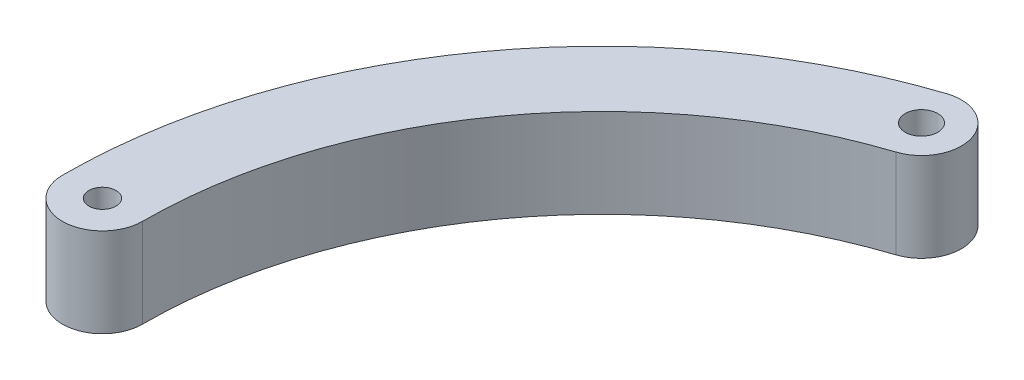
ISO-10303-21;
HEADER;
FILE_DESCRIPTION(('STEP AP214'),'2;1');
FILE_NAME('part.step','',(''),(''),'','','');
FILE_SCHEMA(('AUTOMOTIVE_DESIGN { 1 0 10303 214 1 1 1 1 }'));
ENDSEC;
DATA;
#1=APPLICATION_CONTEXT('core data for automotive mechanical design processes');
#2=APPLICATION_PROTOCOL_DEFINITION('international standard','automotive_design',2000,#1);
#3=PRODUCT_CONTEXT('',#1,'mechanical');
#4=PRODUCT('Part','Part','',(#3));
#5=PRODUCT_RELATED_PRODUCT_CATEGORY('part','',(#4));
#6=PRODUCT_DEFINITION_FORMATION('','',#4);
#7=PRODUCT_DEFINITION_CONTEXT('part definition',#1,'design');
#8=PRODUCT_DEFINITION('design','',#6,#7);
#9=PRODUCT_DEFINITION_SHAPE('','',#8);
#10=(LENGTH_UNIT() NAMED_UNIT(*) SI_UNIT(.MILLI.,.METRE.));
#11=(NAMED_UNIT(*) PLANE_ANGLE_UNIT() SI_UNIT($,.RADIAN.));
#12=(NAMED_UNIT(*) SI_UNIT($,.STERADIAN.) SOLID_ANGLE_UNIT());
#13=UNCERTAINTY_MEASURE_WITH_UNIT(LENGTH_MEASURE(1.E-05),#10,'distance_accuracy_value','');
#14=(GEOMETRIC_REPRESENTATION_CONTEXT(3) GLOBAL_UNCERTAINTY_ASSIGNED_CONTEXT((#13)) GLOBAL_UNIT_ASSIGNED_CONTEXT((#10,
#11,#12)) REPRESENTATION_CONTEXT('',''));
#15=CARTESIAN_POINT('',(0.,0.,0.));
#16=DIRECTION('',(0.,0.,1.));
#17=DIRECTION('',(1.,0.,0.));
#18=AXIS2_PLACEMENT_3D('',#15,#16,#17);
#19=CARTESIAN_POINT('',(-18.25625,6.51002,0.));
#20=DIRECTION('',(0.,-1.,0.));
#21=DIRECTION('',(0.,0.,-1.));
#22=AXIS2_PLACEMENT_3D('',#19,#20,#21);
#23=PLANE('',#22);
#24=CARTESIAN_POINT('',(-36.5125,6.51002,0.));
#25=DIRECTION('',(0.,1.,0.));
#26=DIRECTION('',(0.,0.,-1.));
#27=AXIS2_PLACEMENT_3D('',#24,#25,#26);
#28=CIRCLE('',#27,2.9219891931734);
#29=CARTESIAN_POINT('',(-39.4344891931734,6.51002,0.));
#30=VERTEX_POINT('',#29);
#31=CARTESIAN_POINT('',(-33.5905108068266,6.51002,0.));
#32=VERTEX_POINT('',#31);
#33=EDGE_CURVE('E85',#30,#32,#28,.T.);
#34=ORIENTED_EDGE('',*,*,#33,.T.);
#35=CARTESIAN_POINT('',(0.,6.51002,0.));
#36=DIRECTION('',(0.,-1.,0.));
#37=DIRECTION('',(0.,0.,-1.));
#38=AXIS2_PLACEMENT_3D('',#35,#36,#37);
#39=CIRCLE('',#38,33.5905108068266);
#40=CARTESIAN_POINT('',(-10.4454423964517,6.51002,-31.9251491681079));
#41=VERTEX_POINT('',#40);
#42=EDGE_CURVE('E80',#32,#41,#39,.T.);
#43=ORIENTED_EDGE('',*,*,#42,.T.);
#44=CARTESIAN_POINT('',(-11.3540760869565,6.51002,-34.7022709986191));
#45=DIRECTION('',(0.,1.,0.));
#46=DIRECTION('',(0.,0.,1.));
#47=AXIS2_PLACEMENT_3D('',#44,#45,#46);
#48=CIRCLE('',#47,2.9219891931734);
#49=CARTESIAN_POINT('',(-12.2627097774613,6.51002,-37.4793928291303));
#50=VERTEX_POINT('',#49);
#51=EDGE_CURVE('E83',#41,#50,#48,.T.);
#52=ORIENTED_EDGE('',*,*,#51,.T.);
#53=CARTESIAN_POINT('',(0.,6.51002,0.));
#54=DIRECTION('',(0.,1.,0.));
#55=DIRECTION('',(0.,0.,-1.));
#56=AXIS2_PLACEMENT_3D('',#53,#54,#55);
#57=CIRCLE('',#56,39.4344891931734);
#58=EDGE_CURVE('E50',#50,#30,#57,.T.);
#59=ORIENTED_EDGE('',*,*,#58,.T.);
#60=EDGE_LOOP('',(#34,#43,#52,#59));
#61=FACE_BOUND('',#60,.T.);
#62=CARTESIAN_POINT('',(-11.3540760869565,6.51002,-34.7022709986191));
#63=DIRECTION('',(0.,1.,0.));
#64=DIRECTION('',(0.,0.,1.));
#65=AXIS2_PLACEMENT_3D('',#62,#63,#64);
#66=CIRCLE('',#65,1.190625);
#67=CARTESIAN_POINT('',(-11.3540760869565,6.51002,-33.5116459986191));
#68=VERTEX_POINT('',#67);
#69=EDGE_CURVE('E100',#68,#68,#66,.T.);
#70=ORIENTED_EDGE('',*,*,#69,.F.);
#71=EDGE_LOOP('',(#70));
#72=FACE_BOUND('',#71,.T.);
#73=CARTESIAN_POINT('',(-36.5125,6.51002,0.));
#74=DIRECTION('',(0.,1.,0.));
#75=DIRECTION('',(0.,0.,1.));
#76=AXIS2_PLACEMENT_3D('',#73,#74,#75);
#77=CIRCLE('',#76,0.992187499999998);
#78=CARTESIAN_POINT('',(-36.5125,6.51002,0.992187499999998));
#79=VERTEX_POINT('',#78);
#80=EDGE_CURVE('E115',#79,#79,#77,.T.);
#81=ORIENTED_EDGE('',*,*,#80,.F.);
#82=EDGE_LOOP('',(#81));
#83=FACE_BOUND('',#82,.T.);
#84=ADVANCED_FACE('F33',(#61,#72,#83),#23,.F.);
#85=CARTESIAN_POINT('',(-18.25625,0.,0.));
#86=DIRECTION('',(0.,-1.,0.));
#87=DIRECTION('',(0.,0.,-1.));
#88=AXIS2_PLACEMENT_3D('',#85,#86,#87);
#89=PLANE('',#88);
#90=CARTESIAN_POINT('',(-11.3540760869565,0.,-34.7022709986191));
#91=DIRECTION('',(0.,1.,0.));
#92=DIRECTION('',(0.,0.,1.));
#93=AXIS2_PLACEMENT_3D('',#90,#91,#92);
#94=CIRCLE('',#93,1.190625);
#95=CARTESIAN_POINT('',(-11.3540760869565,0.,-33.5116459986191));
#96=VERTEX_POINT('',#95);
#97=EDGE_CURVE('E112',#96,#96,#94,.T.);
#98=ORIENTED_EDGE('',*,*,#97,.T.);
#99=EDGE_LOOP('',(#98));
#100=FACE_BOUND('',#99,.T.);
#101=CARTESIAN_POINT('',(-36.5125,0.,0.));
#102=DIRECTION('',(0.,1.,0.));
#103=DIRECTION('',(0.,0.,-1.));
#104=AXIS2_PLACEMENT_3D('',#101,#102,#103);
#105=CIRCLE('',#104,2.9219891931734);
#106=CARTESIAN_POINT('',(-39.4344891931734,0.,0.));
#107=VERTEX_POINT('',#106);
#108=CARTESIAN_POINT('',(-33.5905108068266,0.,0.));
#109=VERTEX_POINT('',#108);
#110=EDGE_CURVE('E97',#107,#109,#105,.T.);
#111=ORIENTED_EDGE('',*,*,#110,.F.);
#112=CARTESIAN_POINT('',(0.,0.,0.));
#113=DIRECTION('',(0.,1.,0.));
#114=DIRECTION('',(0.,0.,-1.));
#115=AXIS2_PLACEMENT_3D('',#112,#113,#114);
#116=CIRCLE('',#115,39.4344891931734);
#117=CARTESIAN_POINT('',(-12.2627097774613,0.,-37.4793928291303));
#118=VERTEX_POINT('',#117);
#119=EDGE_CURVE('E73',#118,#107,#116,.T.);
#120=ORIENTED_EDGE('',*,*,#119,.F.);
#121=CARTESIAN_POINT('',(-11.3540760869565,0.,-34.7022709986191));
#122=DIRECTION('',(0.,1.,0.));
#123=DIRECTION('',(0.,0.,1.));
#124=AXIS2_PLACEMENT_3D('',#121,#122,#123);
#125=CIRCLE('',#124,2.9219891931734);
#126=CARTESIAN_POINT('',(-10.4454423964517,0.,-31.9251491681079));
#127=VERTEX_POINT('',#126);
#128=EDGE_CURVE('E67',#127,#118,#125,.T.);
#129=ORIENTED_EDGE('',*,*,#128,.F.);
#130=CARTESIAN_POINT('',(0.,0.,0.));
#131=DIRECTION('',(0.,-1.,0.));
#132=DIRECTION('',(0.,0.,-1.));
#133=AXIS2_PLACEMENT_3D('',#130,#131,#132);
#134=CIRCLE('',#133,33.5905108068266);
#135=EDGE_CURVE('E89',#109,#127,#134,.T.);
#136=ORIENTED_EDGE('',*,*,#135,.F.);
#137=EDGE_LOOP('',(#111,#120,#129,#136));
#138=FACE_BOUND('',#137,.T.);
#139=CARTESIAN_POINT('',(-36.5125,0.,0.));
#140=DIRECTION('',(0.,1.,0.));
#141=DIRECTION('',(0.,0.,1.));
#142=AXIS2_PLACEMENT_3D('',#139,#140,#141);
#143=CIRCLE('',#142,0.992187499999998);
#144=CARTESIAN_POINT('',(-36.5125,0.,0.992187499999998));
#145=VERTEX_POINT('',#144);
#146=EDGE_CURVE('E118',#145,#145,#143,.T.);
#147=ORIENTED_EDGE('',*,*,#146,.T.);
#148=EDGE_LOOP('',(#147));
#149=FACE_BOUND('',#148,.T.);
#150=ADVANCED_FACE('F108',(#100,#138,#149),#89,.T.);
#151=CARTESIAN_POINT('',(-36.5125,6.51002,0.));
#152=DIRECTION('',(0.,-1.,0.));
#153=DIRECTION('',(0.,0.,-1.));
#154=AXIS2_PLACEMENT_3D('',#151,#152,#153);
#155=CYLINDRICAL_SURFACE('',#154,2.9219891931734);
#156=ORIENTED_EDGE('',*,*,#110,.T.);
#157=DIRECTION('',(0.,-1.,0.));
#158=VECTOR('',#157,1.);
#159=CARTESIAN_POINT('',(-33.5905108068266,6.51002,0.));
#160=LINE('',#159,#158);
#161=EDGE_CURVE('E11',#32,#109,#160,.T.);
#162=ORIENTED_EDGE('',*,*,#161,.F.);
#163=ORIENTED_EDGE('',*,*,#33,.F.);
#164=DIRECTION('',(0.,-1.,0.));
#165=VECTOR('',#164,1.);
#166=CARTESIAN_POINT('',(-39.4344891931734,6.51002,0.));
#167=LINE('',#166,#165);
#168=EDGE_CURVE('E93',#30,#107,#167,.T.);
#169=ORIENTED_EDGE('',*,*,#168,.T.);
#170=EDGE_LOOP('',(#156,#162,#163,#169));
#171=FACE_BOUND('',#170,.T.);
#172=ADVANCED_FACE('F35',(#171),#155,.T.);
#173=CARTESIAN_POINT('',(0.,6.51002,0.));
#174=DIRECTION('',(0.,-1.,0.));
#175=DIRECTION('',(0.,0.,-1.));
#176=AXIS2_PLACEMENT_3D('',#173,#174,#175);
#177=CYLINDRICAL_SURFACE('',#176,33.5905108068266);
#178=ORIENTED_EDGE('',*,*,#135,.T.);
#179=DIRECTION('',(0.,-1.,0.));
#180=VECTOR('',#179,1.);
#181=CARTESIAN_POINT('',(-10.4454423964517,6.51002,-31.9251491681079));
#182=LINE('',#181,#180);
#183=EDGE_CURVE('E42',#41,#127,#182,.T.);
#184=ORIENTED_EDGE('',*,*,#183,.F.);
#185=ORIENTED_EDGE('',*,*,#42,.F.);
#186=ORIENTED_EDGE('',*,*,#161,.T.);
#187=EDGE_LOOP('',(#178,#184,#185,#186));
#188=FACE_BOUND('',#187,.T.);
#189=ADVANCED_FACE('F88',(#188),#177,.F.);
#190=CARTESIAN_POINT('',(-11.3540760869565,6.51002,-34.7022709986191));
#191=DIRECTION('',(0.,-1.,0.));
#192=DIRECTION('',(0.,0.,-1.));
#193=AXIS2_PLACEMENT_3D('',#190,#191,#192);
#194=CYLINDRICAL_SURFACE('',#193,2.9219891931734);
#195=ORIENTED_EDGE('',*,*,#128,.T.);
#196=DIRECTION('',(0.,-1.,0.));
#197=VECTOR('',#196,1.);
#198=CARTESIAN_POINT('',(-12.2627097774613,6.51002,-37.4793928291303));
#199=LINE('',#198,#197);
#200=EDGE_CURVE('E90',#50,#118,#199,.T.);
#201=ORIENTED_EDGE('',*,*,#200,.F.);
#202=ORIENTED_EDGE('',*,*,#51,.F.);
#203=ORIENTED_EDGE('',*,*,#183,.T.);
#204=EDGE_LOOP('',(#195,#201,#202,#203));
#205=FACE_BOUND('',#204,.T.);
#206=ADVANCED_FACE('F91',(#205),#194,.T.);
#207=CARTESIAN_POINT('',(0.,6.51002,0.));
#208=DIRECTION('',(0.,-1.,0.));
#209=DIRECTION('',(0.,0.,-1.));
#210=AXIS2_PLACEMENT_3D('',#207,#208,#209);
#211=CYLINDRICAL_SURFACE('',#210,39.4344891931734);
#212=ORIENTED_EDGE('',*,*,#119,.T.);
#213=ORIENTED_EDGE('',*,*,#168,.F.);
#214=ORIENTED_EDGE('',*,*,#58,.F.);
#215=ORIENTED_EDGE('',*,*,#200,.T.);
#216=EDGE_LOOP('',(#212,#213,#214,#215));
#217=FACE_BOUND('',#216,.T.);
#218=ADVANCED_FACE('F105',(#217),#211,.T.);
#219=CARTESIAN_POINT('',(-11.3540760869565,6.51002,-34.7022709986191));
#220=DIRECTION('',(0.,-1.,0.));
#221=DIRECTION('',(0.,0.,-1.));
#222=AXIS2_PLACEMENT_3D('',#219,#220,#221);
#223=CYLINDRICAL_SURFACE('',#222,1.190625);
#224=ORIENTED_EDGE('',*,*,#69,.T.);
#225=EDGE_LOOP('',(#224));
#226=FACE_BOUND('',#225,.T.);
#227=ORIENTED_EDGE('',*,*,#97,.F.);
#228=EDGE_LOOP('',(#227));
#229=FACE_BOUND('',#228,.T.);
#230=ADVANCED_FACE('F135',(#226,#229),#223,.F.);
#231=CARTESIAN_POINT('',(-36.5125,6.51002,0.));
#232=DIRECTION('',(0.,-1.,0.));
#233=DIRECTION('',(0.,0.,-1.));
#234=AXIS2_PLACEMENT_3D('',#231,#232,#233);
#235=CYLINDRICAL_SURFACE('',#234,0.992187499999998);
#236=ORIENTED_EDGE('',*,*,#80,.T.);
#237=EDGE_LOOP('',(#236));
#238=FACE_BOUND('',#237,.T.);
#239=ORIENTED_EDGE('',*,*,#146,.F.);
#240=EDGE_LOOP('',(#239));
#241=FACE_BOUND('',#240,.T.);
#242=ADVANCED_FACE('F124',(#238,#241),#235,.F.);
#243=CLOSED_SHELL('',(#84,#150,#172,#189,#206,#218,#230,#242));
#244=MANIFOLD_SOLID_BREP('B2',#243);
#245=ADVANCED_BREP_SHAPE_REPRESENTATION('',(#18,#244),#14);
#246=SHAPE_DEFINITION_REPRESENTATION(#9,#245);
ENDSEC;
END-ISO-10303-21;
